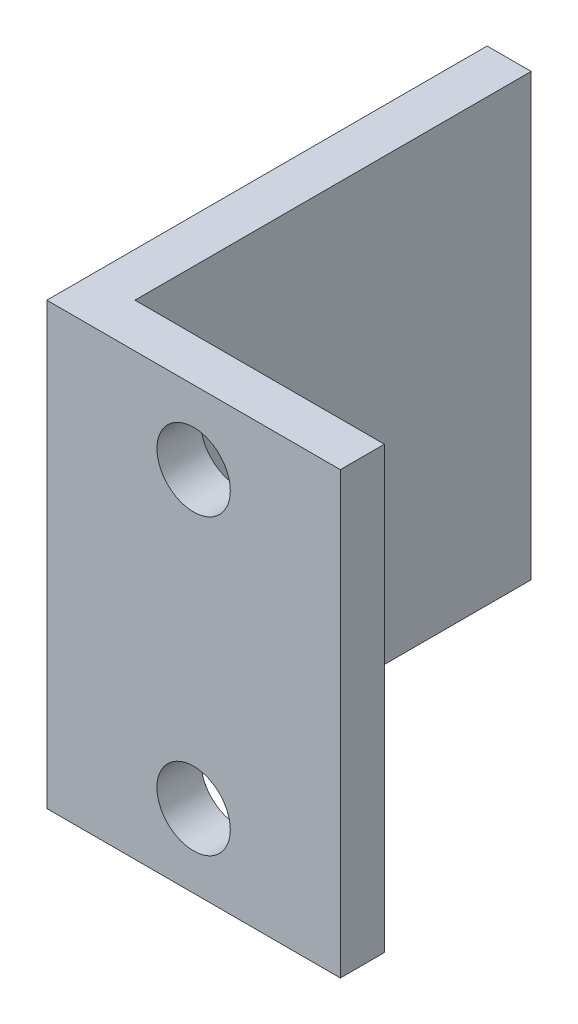
ISO-10303-21;
HEADER;
FILE_DESCRIPTION(('STEP AP214'),'2;1');
FILE_NAME('part.step','',(''),(''),'','','');
FILE_SCHEMA(('AUTOMOTIVE_DESIGN { 1 0 10303 214 1 1 1 1 }'));
ENDSEC;
DATA;
#1=APPLICATION_CONTEXT('core data for automotive mechanical design processes');
#2=APPLICATION_PROTOCOL_DEFINITION('international standard','automotive_design',2000,#1);
#3=PRODUCT_CONTEXT('',#1,'mechanical');
#4=PRODUCT('Part','Part','',(#3));
#5=PRODUCT_RELATED_PRODUCT_CATEGORY('part','',(#4));
#6=PRODUCT_DEFINITION_FORMATION('','',#4);
#7=PRODUCT_DEFINITION_CONTEXT('part definition',#1,'design');
#8=PRODUCT_DEFINITION('design','',#6,#7);
#9=PRODUCT_DEFINITION_SHAPE('','',#8);
#10=(LENGTH_UNIT() NAMED_UNIT(*) SI_UNIT(.MILLI.,.METRE.));
#11=(NAMED_UNIT(*) PLANE_ANGLE_UNIT() SI_UNIT($,.RADIAN.));
#12=(NAMED_UNIT(*) SI_UNIT($,.STERADIAN.) SOLID_ANGLE_UNIT());
#13=UNCERTAINTY_MEASURE_WITH_UNIT(LENGTH_MEASURE(1.E-05),#10,'distance_accuracy_value','');
#14=(GEOMETRIC_REPRESENTATION_CONTEXT(3) GLOBAL_UNCERTAINTY_ASSIGNED_CONTEXT((#13)) GLOBAL_UNIT_ASSIGNED_CONTEXT((#10,
#11,#12)) REPRESENTATION_CONTEXT('',''));
#15=CARTESIAN_POINT('',(0.,0.,0.));
#16=DIRECTION('',(0.,0.,1.));
#17=DIRECTION('',(1.,0.,0.));
#18=AXIS2_PLACEMENT_3D('',#15,#16,#17);
#19=CARTESIAN_POINT('',(3.,30.,-30.));
#20=DIRECTION('',(0.,0.,1.));
#21=DIRECTION('',(1.,0.,0.));
#22=AXIS2_PLACEMENT_3D('',#19,#20,#21);
#23=PLANE('',#22);
#24=DIRECTION('',(-1.,0.,0.));
#25=VECTOR('',#24,1.);
#26=CARTESIAN_POINT('',(3.,0.,-30.));
#27=LINE('',#26,#25);
#28=CARTESIAN_POINT('',(3.,0.,-30.));
#29=VERTEX_POINT('',#28);
#30=CARTESIAN_POINT('',(0.,0.,-30.));
#31=VERTEX_POINT('',#30);
#32=EDGE_CURVE('E124',#29,#31,#27,.T.);
#33=ORIENTED_EDGE('',*,*,#32,.T.);
#34=DIRECTION('',(0.,-1.,0.));
#35=VECTOR('',#34,1.);
#36=CARTESIAN_POINT('',(0.,30.,-30.));
#37=LINE('',#36,#35);
#38=CARTESIAN_POINT('',(0.,30.,-30.));
#39=VERTEX_POINT('',#38);
#40=EDGE_CURVE('E11',#39,#31,#37,.T.);
#41=ORIENTED_EDGE('',*,*,#40,.F.);
#42=DIRECTION('',(-1.,0.,0.));
#43=VECTOR('',#42,1.);
#44=CARTESIAN_POINT('',(3.,30.,-30.));
#45=LINE('',#44,#43);
#46=CARTESIAN_POINT('',(3.,30.,-30.));
#47=VERTEX_POINT('',#46);
#48=EDGE_CURVE('E134',#47,#39,#45,.T.);
#49=ORIENTED_EDGE('',*,*,#48,.F.);
#50=DIRECTION('',(0.,-1.,0.));
#51=VECTOR('',#50,1.);
#52=CARTESIAN_POINT('',(3.,30.,-30.));
#53=LINE('',#52,#51);
#54=EDGE_CURVE('E120',#47,#29,#53,.T.);
#55=ORIENTED_EDGE('',*,*,#54,.T.);
#56=EDGE_LOOP('',(#33,#41,#49,#55));
#57=FACE_BOUND('',#56,.T.);
#58=ADVANCED_FACE('F38',(#57),#23,.F.);
#59=CARTESIAN_POINT('',(0.,30.,-30.));
#60=DIRECTION('',(1.,0.,0.));
#61=DIRECTION('',(0.,0.,-1.));
#62=AXIS2_PLACEMENT_3D('',#59,#60,#61);
#63=PLANE('',#62);
#64=DIRECTION('',(0.,0.,1.));
#65=VECTOR('',#64,1.);
#66=CARTESIAN_POINT('',(0.,0.,-30.));
#67=LINE('',#66,#65);
#68=CARTESIAN_POINT('',(0.,0.,0.));
#69=VERTEX_POINT('',#68);
#70=EDGE_CURVE('E127',#31,#69,#67,.T.);
#71=ORIENTED_EDGE('',*,*,#70,.T.);
#72=DIRECTION('',(0.,-1.,0.));
#73=VECTOR('',#72,1.);
#74=CARTESIAN_POINT('',(0.,30.,0.));
#75=LINE('',#74,#73);
#76=CARTESIAN_POINT('',(0.,30.,0.));
#77=VERTEX_POINT('',#76);
#78=EDGE_CURVE('E47',#77,#69,#75,.T.);
#79=ORIENTED_EDGE('',*,*,#78,.F.);
#80=DIRECTION('',(0.,0.,1.));
#81=VECTOR('',#80,1.);
#82=CARTESIAN_POINT('',(0.,30.,-30.));
#83=LINE('',#82,#81);
#84=EDGE_CURVE('E93',#39,#77,#83,.T.);
#85=ORIENTED_EDGE('',*,*,#84,.F.);
#86=ORIENTED_EDGE('',*,*,#40,.T.);
#87=EDGE_LOOP('',(#71,#79,#85,#86));
#88=FACE_BOUND('',#87,.T.);
#89=ADVANCED_FACE('F156',(#88),#63,.F.);
#90=CARTESIAN_POINT('',(0.,30.,0.));
#91=DIRECTION('',(0.,0.,-1.));
#92=DIRECTION('',(-1.,0.,0.));
#93=AXIS2_PLACEMENT_3D('',#90,#91,#92);
#94=PLANE('',#93);
#95=CARTESIAN_POINT('',(10.,25.,0.));
#96=DIRECTION('',(0.,0.,1.));
#97=DIRECTION('',(1.,0.,0.));
#98=AXIS2_PLACEMENT_3D('',#95,#96,#97);
#99=CIRCLE('',#98,2.5);
#100=CARTESIAN_POINT('',(12.5,25.,0.));
#101=VERTEX_POINT('',#100);
#102=EDGE_CURVE('E141',#101,#101,#99,.T.);
#103=ORIENTED_EDGE('',*,*,#102,.F.);
#104=EDGE_LOOP('',(#103));
#105=FACE_BOUND('',#104,.T.);
#106=CARTESIAN_POINT('',(10.,5.,0.));
#107=DIRECTION('',(0.,0.,1.));
#108=DIRECTION('',(-1.,0.,0.));
#109=AXIS2_PLACEMENT_3D('',#106,#107,#108);
#110=CIRCLE('',#109,2.5);
#111=CARTESIAN_POINT('',(7.5,5.,0.));
#112=VERTEX_POINT('',#111);
#113=EDGE_CURVE('E146',#112,#112,#110,.T.);
#114=ORIENTED_EDGE('',*,*,#113,.F.);
#115=EDGE_LOOP('',(#114));
#116=FACE_BOUND('',#115,.T.);
#117=DIRECTION('',(1.,0.,0.));
#118=VECTOR('',#117,1.);
#119=CARTESIAN_POINT('',(0.,0.,0.));
#120=LINE('',#119,#118);
#121=CARTESIAN_POINT('',(20.,0.,0.));
#122=VERTEX_POINT('',#121);
#123=EDGE_CURVE('E129',#69,#122,#120,.T.);
#124=ORIENTED_EDGE('',*,*,#123,.T.);
#125=DIRECTION('',(0.,-1.,0.));
#126=VECTOR('',#125,1.);
#127=CARTESIAN_POINT('',(20.,30.,0.));
#128=LINE('',#127,#126);
#129=CARTESIAN_POINT('',(20.,30.,0.));
#130=VERTEX_POINT('',#129);
#131=EDGE_CURVE('E115',#130,#122,#128,.T.);
#132=ORIENTED_EDGE('',*,*,#131,.F.);
#133=DIRECTION('',(1.,0.,0.));
#134=VECTOR('',#133,1.);
#135=CARTESIAN_POINT('',(0.,30.,0.));
#136=LINE('',#135,#134);
#137=EDGE_CURVE('E106',#77,#130,#136,.T.);
#138=ORIENTED_EDGE('',*,*,#137,.F.);
#139=ORIENTED_EDGE('',*,*,#78,.T.);
#140=EDGE_LOOP('',(#124,#132,#138,#139));
#141=FACE_BOUND('',#140,.T.);
#142=ADVANCED_FACE('F159',(#105,#116,#141),#94,.F.);
#143=CARTESIAN_POINT('',(20.,30.,0.));
#144=DIRECTION('',(-1.,0.,0.));
#145=DIRECTION('',(0.,0.,1.));
#146=AXIS2_PLACEMENT_3D('',#143,#144,#145);
#147=PLANE('',#146);
#148=DIRECTION('',(0.,0.,-1.));
#149=VECTOR('',#148,1.);
#150=CARTESIAN_POINT('',(20.,0.,0.));
#151=LINE('',#150,#149);
#152=CARTESIAN_POINT('',(20.,0.,-3.));
#153=VERTEX_POINT('',#152);
#154=EDGE_CURVE('E114',#122,#153,#151,.T.);
#155=ORIENTED_EDGE('',*,*,#154,.T.);
#156=DIRECTION('',(0.,-1.,0.));
#157=VECTOR('',#156,1.);
#158=CARTESIAN_POINT('',(20.,30.,-3.));
#159=LINE('',#158,#157);
#160=CARTESIAN_POINT('',(20.,30.,-3.));
#161=VERTEX_POINT('',#160);
#162=EDGE_CURVE('E111',#161,#153,#159,.T.);
#163=ORIENTED_EDGE('',*,*,#162,.F.);
#164=DIRECTION('',(0.,0.,-1.));
#165=VECTOR('',#164,1.);
#166=CARTESIAN_POINT('',(20.,30.,0.));
#167=LINE('',#166,#165);
#168=EDGE_CURVE('E100',#130,#161,#167,.T.);
#169=ORIENTED_EDGE('',*,*,#168,.F.);
#170=ORIENTED_EDGE('',*,*,#131,.T.);
#171=EDGE_LOOP('',(#155,#163,#169,#170));
#172=FACE_BOUND('',#171,.T.);
#173=ADVANCED_FACE('F112',(#172),#147,.F.);
#174=CARTESIAN_POINT('',(20.,30.,-3.));
#175=DIRECTION('',(0.,0.,1.));
#176=DIRECTION('',(1.,0.,0.));
#177=AXIS2_PLACEMENT_3D('',#174,#175,#176);
#178=PLANE('',#177);
#179=CARTESIAN_POINT('',(10.,25.,-3.));
#180=DIRECTION('',(0.,0.,1.));
#181=DIRECTION('',(1.,0.,0.));
#182=AXIS2_PLACEMENT_3D('',#179,#180,#181);
#183=CIRCLE('',#182,2.5);
#184=CARTESIAN_POINT('',(12.5,25.,-3.));
#185=VERTEX_POINT('',#184);
#186=EDGE_CURVE('E41',#185,#185,#183,.T.);
#187=ORIENTED_EDGE('',*,*,#186,.T.);
#188=EDGE_LOOP('',(#187));
#189=FACE_BOUND('',#188,.T.);
#190=CARTESIAN_POINT('',(10.,5.,-3.));
#191=DIRECTION('',(0.,0.,1.));
#192=DIRECTION('',(1.,0.,0.));
#193=AXIS2_PLACEMENT_3D('',#190,#191,#192);
#194=CIRCLE('',#193,2.5);
#195=CARTESIAN_POINT('',(12.5,5.,-3.));
#196=VERTEX_POINT('',#195);
#197=EDGE_CURVE('E139',#196,#196,#194,.T.);
#198=ORIENTED_EDGE('',*,*,#197,.T.);
#199=EDGE_LOOP('',(#198));
#200=FACE_BOUND('',#199,.T.);
#201=DIRECTION('',(-1.,0.,0.));
#202=VECTOR('',#201,1.);
#203=CARTESIAN_POINT('',(20.,0.,-3.));
#204=LINE('',#203,#202);
#205=CARTESIAN_POINT('',(3.,0.,-3.));
#206=VERTEX_POINT('',#205);
#207=EDGE_CURVE('E79',#153,#206,#204,.T.);
#208=ORIENTED_EDGE('',*,*,#207,.T.);
#209=DIRECTION('',(0.,-1.,0.));
#210=VECTOR('',#209,1.);
#211=CARTESIAN_POINT('',(3.,30.,-3.));
#212=LINE('',#211,#210);
#213=CARTESIAN_POINT('',(3.,30.,-3.));
#214=VERTEX_POINT('',#213);
#215=EDGE_CURVE('E116',#214,#206,#212,.T.);
#216=ORIENTED_EDGE('',*,*,#215,.F.);
#217=DIRECTION('',(-1.,0.,0.));
#218=VECTOR('',#217,1.);
#219=CARTESIAN_POINT('',(20.,30.,-3.));
#220=LINE('',#219,#218);
#221=EDGE_CURVE('E104',#161,#214,#220,.T.);
#222=ORIENTED_EDGE('',*,*,#221,.F.);
#223=ORIENTED_EDGE('',*,*,#162,.T.);
#224=EDGE_LOOP('',(#208,#216,#222,#223));
#225=FACE_BOUND('',#224,.T.);
#226=ADVANCED_FACE('F118',(#189,#200,#225),#178,.F.);
#227=CARTESIAN_POINT('',(3.,30.,-3.));
#228=DIRECTION('',(-1.,0.,0.));
#229=DIRECTION('',(0.,0.,1.));
#230=AXIS2_PLACEMENT_3D('',#227,#228,#229);
#231=PLANE('',#230);
#232=DIRECTION('',(0.,0.,-1.));
#233=VECTOR('',#232,1.);
#234=CARTESIAN_POINT('',(3.,0.,-3.));
#235=LINE('',#234,#233);
#236=EDGE_CURVE('E85',#206,#29,#235,.T.);
#237=ORIENTED_EDGE('',*,*,#236,.T.);
#238=ORIENTED_EDGE('',*,*,#54,.F.);
#239=DIRECTION('',(0.,0.,-1.));
#240=VECTOR('',#239,1.);
#241=CARTESIAN_POINT('',(3.,30.,-3.));
#242=LINE('',#241,#240);
#243=EDGE_CURVE('E56',#214,#47,#242,.T.);
#244=ORIENTED_EDGE('',*,*,#243,.F.);
#245=ORIENTED_EDGE('',*,*,#215,.T.);
#246=EDGE_LOOP('',(#237,#238,#244,#245));
#247=FACE_BOUND('',#246,.T.);
#248=ADVANCED_FACE('F164',(#247),#231,.F.);
#249=CARTESIAN_POINT('',(0.,30.,0.));
#250=DIRECTION('',(0.,1.,0.));
#251=DIRECTION('',(0.,0.,1.));
#252=AXIS2_PLACEMENT_3D('',#249,#250,#251);
#253=PLANE('',#252);
#254=ORIENTED_EDGE('',*,*,#48,.T.);
#255=ORIENTED_EDGE('',*,*,#84,.T.);
#256=ORIENTED_EDGE('',*,*,#137,.T.);
#257=ORIENTED_EDGE('',*,*,#168,.T.);
#258=ORIENTED_EDGE('',*,*,#221,.T.);
#259=ORIENTED_EDGE('',*,*,#243,.T.);
#260=EDGE_LOOP('',(#254,#255,#256,#257,#258,#259));
#261=FACE_BOUND('',#260,.T.);
#262=ADVANCED_FACE('F102',(#261),#253,.T.);
#263=CARTESIAN_POINT('',(0.,0.,0.));
#264=DIRECTION('',(0.,1.,0.));
#265=DIRECTION('',(0.,0.,1.));
#266=AXIS2_PLACEMENT_3D('',#263,#264,#265);
#267=PLANE('',#266);
#268=ORIENTED_EDGE('',*,*,#32,.F.);
#269=ORIENTED_EDGE('',*,*,#236,.F.);
#270=ORIENTED_EDGE('',*,*,#207,.F.);
#271=ORIENTED_EDGE('',*,*,#154,.F.);
#272=ORIENTED_EDGE('',*,*,#123,.F.);
#273=ORIENTED_EDGE('',*,*,#70,.F.);
#274=EDGE_LOOP('',(#268,#269,#270,#271,#272,#273));
#275=FACE_BOUND('',#274,.T.);
#276=ADVANCED_FACE('F162',(#275),#267,.F.);
#277=CARTESIAN_POINT('',(10.,5.,-30.));
#278=DIRECTION('',(0.,0.,1.));
#279=DIRECTION('',(1.,0.,0.));
#280=AXIS2_PLACEMENT_3D('',#277,#278,#279);
#281=CYLINDRICAL_SURFACE('',#280,2.5);
#282=ORIENTED_EDGE('',*,*,#113,.T.);
#283=EDGE_LOOP('',(#282));
#284=FACE_BOUND('',#283,.T.);
#285=ORIENTED_EDGE('',*,*,#197,.F.);
#286=EDGE_LOOP('',(#285));
#287=FACE_BOUND('',#286,.T.);
#288=ADVANCED_FACE('F203',(#284,#287),#281,.F.);
#289=CARTESIAN_POINT('',(10.,25.,-30.));
#290=DIRECTION('',(0.,0.,1.));
#291=DIRECTION('',(1.,0.,0.));
#292=AXIS2_PLACEMENT_3D('',#289,#290,#291);
#293=CYLINDRICAL_SURFACE('',#292,2.5);
#294=ORIENTED_EDGE('',*,*,#102,.T.);
#295=EDGE_LOOP('',(#294));
#296=FACE_BOUND('',#295,.T.);
#297=ORIENTED_EDGE('',*,*,#186,.F.);
#298=EDGE_LOOP('',(#297));
#299=FACE_BOUND('',#298,.T.);
#300=ADVANCED_FACE('F208',(#296,#299),#293,.F.);
#301=CLOSED_SHELL('',(#58,#89,#142,#173,#226,#248,#262,#276,#288,#300));
#302=MANIFOLD_SOLID_BREP('B2',#301);
#303=ADVANCED_BREP_SHAPE_REPRESENTATION('',(#18,#302),#14);
#304=SHAPE_DEFINITION_REPRESENTATION(#9,#303);
ENDSEC;
END-ISO-10303-21;
